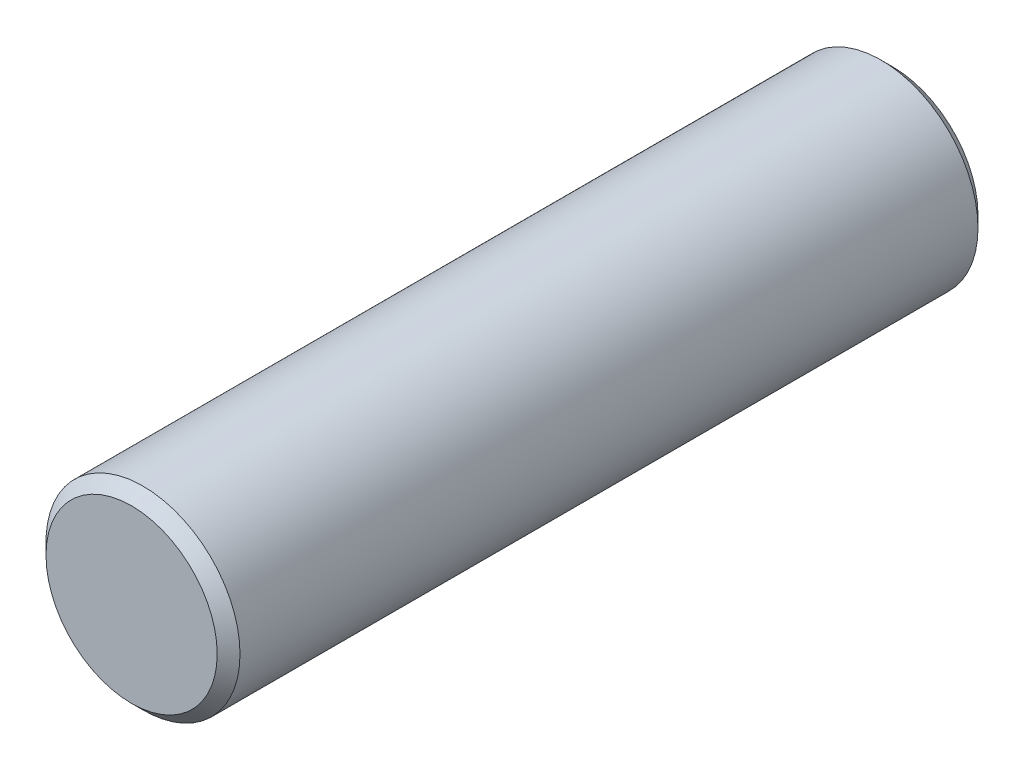
ISO-10303-21;
HEADER;
FILE_DESCRIPTION(('STEP AP214'),'2;1');
FILE_NAME('part.step','',(''),(''),'','','');
FILE_SCHEMA(('AUTOMOTIVE_DESIGN { 1 0 10303 214 1 1 1 1 }'));
ENDSEC;
DATA;
#1=APPLICATION_CONTEXT('core data for automotive mechanical design processes');
#2=APPLICATION_PROTOCOL_DEFINITION('international standard','automotive_design',2000,#1);
#3=PRODUCT_CONTEXT('',#1,'mechanical');
#4=PRODUCT('Part','Part','',(#3));
#5=PRODUCT_RELATED_PRODUCT_CATEGORY('part','',(#4));
#6=PRODUCT_DEFINITION_FORMATION('','',#4);
#7=PRODUCT_DEFINITION_CONTEXT('part definition',#1,'design');
#8=PRODUCT_DEFINITION('design','',#6,#7);
#9=PRODUCT_DEFINITION_SHAPE('','',#8);
#10=(LENGTH_UNIT() NAMED_UNIT(*) SI_UNIT(.MILLI.,.METRE.));
#11=(NAMED_UNIT(*) PLANE_ANGLE_UNIT() SI_UNIT($,.RADIAN.));
#12=(NAMED_UNIT(*) SI_UNIT($,.STERADIAN.) SOLID_ANGLE_UNIT());
#13=UNCERTAINTY_MEASURE_WITH_UNIT(LENGTH_MEASURE(1.E-05),#10,'distance_accuracy_value','');
#14=(GEOMETRIC_REPRESENTATION_CONTEXT(3) GLOBAL_UNCERTAINTY_ASSIGNED_CONTEXT((#13)) GLOBAL_UNIT_ASSIGNED_CONTEXT((#10,
#11,#12)) REPRESENTATION_CONTEXT('',''));
#15=CARTESIAN_POINT('',(0.,0.,0.));
#16=DIRECTION('',(0.,0.,1.));
#17=DIRECTION('',(1.,0.,0.));
#18=AXIS2_PLACEMENT_3D('',#15,#16,#17);
#19=CARTESIAN_POINT('',(0.,0.,25.4));
#20=DIRECTION('',(0.,0.,-1.));
#21=DIRECTION('',(-1.,0.,0.));
#22=AXIS2_PLACEMENT_3D('',#19,#20,#21);
#23=CYLINDRICAL_SURFACE('',#22,3.2385);
#24=CARTESIAN_POINT('',(0.,0.,0.380999999999992));
#25=DIRECTION('',(0.,0.,1.));
#26=DIRECTION('',(1.,0.,0.));
#27=AXIS2_PLACEMENT_3D('',#24,#25,#26);
#28=CIRCLE('',#27,3.2385);
#29=CARTESIAN_POINT('',(3.2385,0.,0.380999999999992));
#30=VERTEX_POINT('',#29);
#31=EDGE_CURVE('E54',#30,#30,#28,.T.);
#32=ORIENTED_EDGE('',*,*,#31,.T.);
#33=EDGE_LOOP('',(#32));
#34=FACE_BOUND('',#33,.T.);
#35=CARTESIAN_POINT('',(0.,0.,25.019));
#36=DIRECTION('',(0.,0.,1.));
#37=DIRECTION('',(1.,0.,0.));
#38=AXIS2_PLACEMENT_3D('',#35,#36,#37);
#39=CIRCLE('',#38,3.2385);
#40=CARTESIAN_POINT('',(3.2385,0.,25.019));
#41=VERTEX_POINT('',#40);
#42=EDGE_CURVE('E58',#41,#41,#39,.F.);
#43=ORIENTED_EDGE('',*,*,#42,.T.);
#44=EDGE_LOOP('',(#43));
#45=FACE_BOUND('',#44,.T.);
#46=ADVANCED_FACE('F43',(#34,#45),#23,.T.);
#47=CARTESIAN_POINT('',(0.,0.,25.4));
#48=DIRECTION('',(0.,0.,1.));
#49=DIRECTION('',(1.,0.,0.));
#50=AXIS2_PLACEMENT_3D('',#47,#48,#49);
#51=PLANE('',#50);
#52=CARTESIAN_POINT('',(0.,0.,25.4));
#53=DIRECTION('',(0.,0.,1.));
#54=DIRECTION('',(1.,0.,0.));
#55=AXIS2_PLACEMENT_3D('',#52,#53,#54);
#56=CIRCLE('',#55,2.8575);
#57=CARTESIAN_POINT('',(2.8575,0.,25.4));
#58=VERTEX_POINT('',#57);
#59=EDGE_CURVE('E12',#58,#58,#56,.T.);
#60=ORIENTED_EDGE('',*,*,#59,.T.);
#61=EDGE_LOOP('',(#60));
#62=FACE_BOUND('',#61,.T.);
#63=ADVANCED_FACE('F74',(#62),#51,.T.);
#64=CARTESIAN_POINT('',(0.,0.,0.));
#65=DIRECTION('',(0.,0.,1.));
#66=DIRECTION('',(1.,0.,0.));
#67=AXIS2_PLACEMENT_3D('',#64,#65,#66);
#68=PLANE('',#67);
#69=CARTESIAN_POINT('',(0.,0.,0.));
#70=DIRECTION('',(0.,0.,1.));
#71=DIRECTION('',(1.,0.,0.));
#72=AXIS2_PLACEMENT_3D('',#69,#70,#71);
#73=CIRCLE('',#72,2.85750000000001);
#74=CARTESIAN_POINT('',(2.85750000000001,0.,0.));
#75=VERTEX_POINT('',#74);
#76=EDGE_CURVE('E50',#75,#75,#73,.F.);
#77=ORIENTED_EDGE('',*,*,#76,.T.);
#78=EDGE_LOOP('',(#77));
#79=FACE_BOUND('',#78,.T.);
#80=ADVANCED_FACE('F71',(#79),#68,.F.);
#81=CARTESIAN_POINT('',(0.,0.,0.380999999999992));
#82=DIRECTION('',(0.,0.,1.));
#83=DIRECTION('',(1.,0.,0.));
#84=AXIS2_PLACEMENT_3D('',#81,#82,#83);
#85=CONICAL_SURFACE('',#84,3.2385,0.785398163397447);
#86=ORIENTED_EDGE('',*,*,#76,.F.);
#87=EDGE_LOOP('',(#86));
#88=FACE_BOUND('',#87,.T.);
#89=ORIENTED_EDGE('',*,*,#31,.F.);
#90=EDGE_LOOP('',(#89));
#91=FACE_BOUND('',#90,.T.);
#92=ADVANCED_FACE('F67',(#88,#91),#85,.T.);
#93=CARTESIAN_POINT('',(0.,0.,25.4));
#94=DIRECTION('',(0.,0.,-1.));
#95=DIRECTION('',(-1.,0.,0.));
#96=AXIS2_PLACEMENT_3D('',#93,#94,#95);
#97=CONICAL_SURFACE('',#96,2.8575,0.785398163397443);
#98=ORIENTED_EDGE('',*,*,#42,.F.);
#99=EDGE_LOOP('',(#98));
#100=FACE_BOUND('',#99,.T.);
#101=ORIENTED_EDGE('',*,*,#59,.F.);
#102=EDGE_LOOP('',(#101));
#103=FACE_BOUND('',#102,.T.);
#104=ADVANCED_FACE('F45',(#100,#103),#97,.T.);
#105=CLOSED_SHELL('',(#46,#63,#80,#92,#104));
#106=MANIFOLD_SOLID_BREP('B2',#105);
#107=ADVANCED_BREP_SHAPE_REPRESENTATION('',(#18,#106),#14);
#108=SHAPE_DEFINITION_REPRESENTATION(#9,#107);
ENDSEC;
END-ISO-10303-21;
